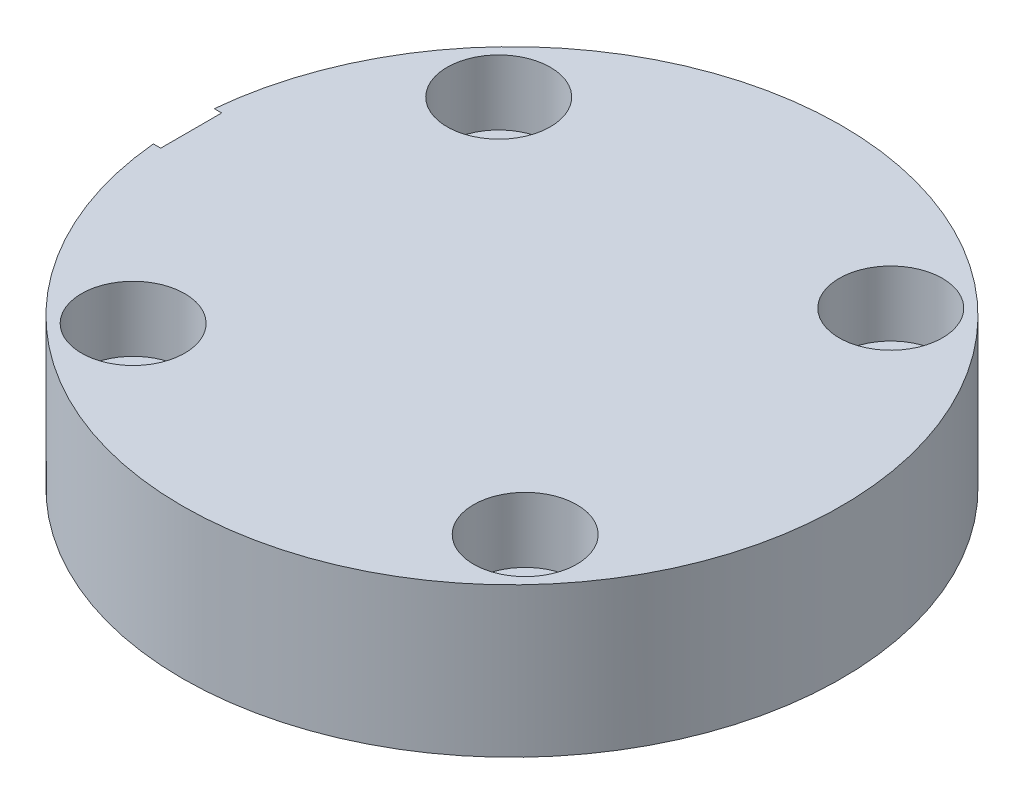
ISO-10303-21;
HEADER;
FILE_DESCRIPTION(('STEP AP214'),'2;1');
FILE_NAME('part.step','',(''),(''),'','','');
FILE_SCHEMA(('AUTOMOTIVE_DESIGN { 1 0 10303 214 1 1 1 1 }'));
ENDSEC;
DATA;
#1=APPLICATION_CONTEXT('core data for automotive mechanical design processes');
#2=APPLICATION_PROTOCOL_DEFINITION('international standard','automotive_design',2000,#1);
#3=PRODUCT_CONTEXT('',#1,'mechanical');
#4=PRODUCT('Part','Part','',(#3));
#5=PRODUCT_RELATED_PRODUCT_CATEGORY('part','',(#4));
#6=PRODUCT_DEFINITION_FORMATION('','',#4);
#7=PRODUCT_DEFINITION_CONTEXT('part definition',#1,'design');
#8=PRODUCT_DEFINITION('design','',#6,#7);
#9=PRODUCT_DEFINITION_SHAPE('','',#8);
#10=(LENGTH_UNIT() NAMED_UNIT(*) SI_UNIT(.MILLI.,.METRE.));
#11=(NAMED_UNIT(*) PLANE_ANGLE_UNIT() SI_UNIT($,.RADIAN.));
#12=(NAMED_UNIT(*) SI_UNIT($,.STERADIAN.) SOLID_ANGLE_UNIT());
#13=UNCERTAINTY_MEASURE_WITH_UNIT(LENGTH_MEASURE(1.E-05),#10,'distance_accuracy_value','');
#14=(GEOMETRIC_REPRESENTATION_CONTEXT(3) GLOBAL_UNCERTAINTY_ASSIGNED_CONTEXT((#13)) GLOBAL_UNIT_ASSIGNED_CONTEXT((#10,
#11,#12)) REPRESENTATION_CONTEXT('',''));
#15=CARTESIAN_POINT('',(0.,0.,0.));
#16=DIRECTION('',(0.,0.,1.));
#17=DIRECTION('',(1.,0.,0.));
#18=AXIS2_PLACEMENT_3D('',#15,#16,#17);
#19=CARTESIAN_POINT('',(-7.87399999990157,5.08,0.));
#20=DIRECTION('',(-1.,0.,0.));
#21=DIRECTION('',(0.,0.,1.));
#22=AXIS2_PLACEMENT_3D('',#19,#20,#21);
#23=CONICAL_SURFACE('',#22,1.983739999766,1.04719755101781);
#24=CARTESIAN_POINT('',(-6.72868717691699,5.08000000024822,0.));
#25=VERTEX_POINT('',#24);
#26=VERTEX_LOOP('',#25);
#27=FACE_BOUND('',#26,.T.);
#28=CARTESIAN_POINT('',(-7.87400000002046,4.31799999998885,1.8315513608851));
#29=CARTESIAN_POINT('',(-7.82992641507165,4.31799999999599,1.7487874157982));
#30=CARTESIAN_POINT('',(-7.78612853155752,4.31799999999893,1.66587183864565));
#31=CARTESIAN_POINT('',(-7.69951532697555,4.31800000000108,1.49941735932508));
#32=CARTESIAN_POINT('',(-7.65670110926625,4.31800000000029,1.4158778843539));
#33=CARTESIAN_POINT('',(-7.57033367638741,4.31799999999969,1.24354391983241));
#34=CARTESIAN_POINT('',(-7.52686338570844,4.31799999999994,1.15470731721397));
#35=CARTESIAN_POINT('',(-7.4638282424196,4.31800000000003,1.02045059617735));
#36=CARTESIAN_POINT('',(-7.44318188491735,4.31800000000001,0.975539839632032));
#37=CARTESIAN_POINT('',(-7.4028656854967,4.31799999999999,0.88528360930255));
#38=CARTESIAN_POINT('',(-7.38319577512093,4.318,0.839938166260351));
#39=CARTESIAN_POINT('',(-7.34376060487868,4.318,0.745289070746328));
#40=CARTESIAN_POINT('',(-7.3240976091331,4.318,0.69594240252209));
#41=CARTESIAN_POINT('',(-7.28693048358289,4.318,0.596410046130136));
#42=CARTESIAN_POINT('',(-7.26942712282796,4.318,0.546224066264776));
#43=CARTESIAN_POINT('',(-7.23782362064461,4.318,0.445817244694537));
#44=CARTESIAN_POINT('',(-7.22366519781957,4.318,0.395615139230935));
#45=CARTESIAN_POINT('',(-7.19953652322499,4.318,0.294233784560262));
#46=CARTESIAN_POINT('',(-7.18956155964946,4.318,0.243055702907522));
#47=CARTESIAN_POINT('',(-7.17638225084909,4.318,0.149378599825421));
#48=CARTESIAN_POINT('',(-7.1722714281669,4.318,0.107010084573329));
#49=CARTESIAN_POINT('',(-7.16813574122286,4.318,0.0220823809694541));
#50=CARTESIAN_POINT('',(-7.16810925530471,4.318,-0.020476724997631));
#51=CARTESIAN_POINT('',(-7.17217831317842,4.318,-0.106140326277238));
#52=CARTESIAN_POINT('',(-7.17634630374353,4.318,-0.1492412625259));
#53=CARTESIAN_POINT('',(-7.18843183722638,4.318,-0.234905726770033));
#54=CARTESIAN_POINT('',(-7.19635034442225,4.318,-0.277469113667662));
#55=CARTESIAN_POINT('',(-7.22130051202808,4.318,-0.38921137660387));
#56=CARTESIAN_POINT('',(-7.24091400946646,4.318,-0.457802750432506));
#57=CARTESIAN_POINT('',(-7.28532676075777,4.318,-0.593315839970755));
#58=CARTESIAN_POINT('',(-7.31013445530008,4.318,-0.660234637100207));
#59=CARTESIAN_POINT('',(-7.36312317579871,4.318,-0.793223443669407));
#60=CARTESIAN_POINT('',(-7.39132568943498,4.318,-0.859284762260099));
#61=CARTESIAN_POINT('',(-7.44976755026002,4.318,-0.990433560919312));
#62=CARTESIAN_POINT('',(-7.48000549787957,4.318,-1.05552167328235));
#63=CARTESIAN_POINT('',(-7.53980162534114,4.318,-1.18077415478785));
#64=CARTESIAN_POINT('',(-7.56927312674534,4.318,-1.24098015911951));
#65=CARTESIAN_POINT('',(-7.62905869548584,4.318,-1.36098500583929));
#66=CARTESIAN_POINT('',(-7.65937292043676,4.318,-1.42078376942182));
#67=CARTESIAN_POINT('',(-7.72016672603709,4.318,-1.53921324381936));
#68=CARTESIAN_POINT('',(-7.7506376801483,4.318,-1.59784839629121));
#69=CARTESIAN_POINT('',(-7.81202070273508,4.318,-1.71486748913878));
#70=CARTESIAN_POINT('',(-7.84293265051441,4.318,-1.77325149276679));
#71=CARTESIAN_POINT('',(-7.87400000002975,4.318,-1.83155136088302));
#72=B_SPLINE_CURVE_WITH_KNOTS('',3,(#28,#29,#30,#31,#32,#33,#34,#35,#36,#37,#38,#39,#40,#41,#42,
#43,#44,#45,#46,#47,#48,#49,#50,#51,#52,#53,#54,#55,#56,#57,#58,#59,#60,#61,#62,#63,#64,#65,#66,
#67,#68,#69,#70,#71),.UNSPECIFIED.,.F.,.F.,(4,2,2,2,2,2,2,2,2,2,2,2,2,2,2,2,2,2,2,2,2,4),(0.,
0.281307642365523,0.562916773289566,0.859585824160608,1.00786515542674,1.15613407630821,
1.31545920995369,1.47484091679935,1.63119792479809,1.78737835277337,1.91490226065231,
2.04237553595827,2.1720889661006,2.30183576438626,2.51548453077995,2.7294832139832,
2.94491568673733,3.16020151160627,3.36128974921865,3.56241585281412,3.76065360187342,
3.95883809795668),.UNSPECIFIED.);
#73=CARTESIAN_POINT('',(-7.87400000001428,4.318,1.83155136088839));
#74=VERTEX_POINT('',#73);
#75=CARTESIAN_POINT('',(-7.87400000001428,4.318,-1.83155136088839));
#76=VERTEX_POINT('',#75);
#77=EDGE_CURVE('E21',#74,#76,#72,.T.);
#78=ORIENTED_EDGE('',*,*,#77,.F.);
#79=CARTESIAN_POINT('',(-7.874,5.08,0.));
#80=DIRECTION('',(-1.,0.,0.));
#81=DIRECTION('',(0.,-1.,0.));
#82=AXIS2_PLACEMENT_3D('',#79,#80,#81);
#83=CIRCLE('',#82,1.98374);
#84=EDGE_CURVE('E290',#74,#76,#83,.T.);
#85=ORIENTED_EDGE('',*,*,#84,.T.);
#86=EDGE_LOOP('',(#78,#85));
#87=FACE_BOUND('',#86,.T.);
#88=ADVANCED_FACE('F17',(#27,#87),#23,.F.);
#89=CARTESIAN_POINT('',(0.,4.318,0.));
#90=DIRECTION('',(0.,-1.,0.));
#91=DIRECTION('',(0.,0.,-1.));
#92=AXIS2_PLACEMENT_3D('',#89,#90,#91);
#93=PLANE('',#92);
#94=DIRECTION('',(-1.,0.,0.));
#95=VECTOR('',#94,1.);
#96=CARTESIAN_POINT('',(-6.72868717699777,4.318,1.831551360896));
#97=LINE('',#96,#95);
#98=CARTESIAN_POINT('',(-10.1484488160704,4.318,1.831551360896));
#99=VERTEX_POINT('',#98);
#100=EDGE_CURVE('E292',#99,#74,#97,.F.);
#101=ORIENTED_EDGE('',*,*,#100,.T.);
#102=ORIENTED_EDGE('',*,*,#77,.T.);
#103=DIRECTION('',(-1.,0.,0.));
#104=VECTOR('',#103,1.);
#105=CARTESIAN_POINT('',(-6.72868717699777,4.318,-1.831551360896));
#106=LINE('',#105,#104);
#107=CARTESIAN_POINT('',(-10.1484488160704,4.318,-1.831551360896));
#108=VERTEX_POINT('',#107);
#109=EDGE_CURVE('E177',#76,#108,#106,.T.);
#110=ORIENTED_EDGE('',*,*,#109,.T.);
#111=CARTESIAN_POINT('',(0.,4.318,0.));
#112=DIRECTION('',(0.,1.,0.));
#113=DIRECTION('',(0.,0.,1.));
#114=AXIS2_PLACEMENT_3D('',#111,#112,#113);
#115=CIRCLE('',#114,10.3124);
#116=EDGE_CURVE('E176',#108,#99,#115,.F.);
#117=ORIENTED_EDGE('',*,*,#116,.T.);
#118=EDGE_LOOP('',(#101,#102,#110,#117));
#119=FACE_BOUND('',#118,.T.);
#120=ADVANCED_FACE('F64',(#119),#93,.T.);
#121=CARTESIAN_POINT('',(14.9304902420144,4.318,-4.14059139895652));
#122=DIRECTION('',(0.,1.,0.));
#123=DIRECTION('',(0.,0.,1.));
#124=AXIS2_PLACEMENT_3D('',#121,#122,#123);
#125=PLANE('',#124);
#126=CARTESIAN_POINT('',(14.9304902420144,4.318,-4.14059139895652));
#127=DIRECTION('',(0.,1.,0.));
#128=DIRECTION('',(0.,0.,1.));
#129=AXIS2_PLACEMENT_3D('',#126,#127,#128);
#130=CIRCLE('',#129,1.7272);
#131=CARTESIAN_POINT('',(14.9304902420144,4.318,-2.41339139895652));
#132=VERTEX_POINT('',#131);
#133=EDGE_CURVE('E180',#132,#132,#130,.F.);
#134=ORIENTED_EDGE('',*,*,#133,.T.);
#135=EDGE_LOOP('',(#134));
#136=FACE_BOUND('',#135,.T.);
#137=ADVANCED_FACE('F69',(#136),#125,.F.);
#138=CARTESIAN_POINT('',(-14.9304902420144,4.318,4.14059139895652));
#139=DIRECTION('',(0.,1.,0.));
#140=DIRECTION('',(0.,0.,1.));
#141=AXIS2_PLACEMENT_3D('',#138,#139,#140);
#142=PLANE('',#141);
#143=CARTESIAN_POINT('',(-14.9304902420144,4.318,4.14059139895652));
#144=DIRECTION('',(0.,1.,0.));
#145=DIRECTION('',(0.,0.,1.));
#146=AXIS2_PLACEMENT_3D('',#143,#144,#145);
#147=CIRCLE('',#146,1.7272);
#148=CARTESIAN_POINT('',(-14.9304902420144,4.318,5.86779139895652));
#149=VERTEX_POINT('',#148);
#150=EDGE_CURVE('E183',#149,#149,#147,.F.);
#151=ORIENTED_EDGE('',*,*,#150,.T.);
#152=EDGE_LOOP('',(#151));
#153=FACE_BOUND('',#152,.T.);
#154=ADVANCED_FACE('F263',(#153),#142,.F.);
#155=CARTESIAN_POINT('',(4.14059139895652,4.318,14.9304902420144));
#156=DIRECTION('',(0.,1.,0.));
#157=DIRECTION('',(0.,0.,1.));
#158=AXIS2_PLACEMENT_3D('',#155,#156,#157);
#159=PLANE('',#158);
#160=CARTESIAN_POINT('',(4.14059139895652,4.318,14.9304902420144));
#161=DIRECTION('',(0.,1.,0.));
#162=DIRECTION('',(0.,0.,1.));
#163=AXIS2_PLACEMENT_3D('',#160,#161,#162);
#164=CIRCLE('',#163,1.7272);
#165=CARTESIAN_POINT('',(4.14059139895652,4.318,16.6576902420144));
#166=VERTEX_POINT('',#165);
#167=EDGE_CURVE('E186',#166,#166,#164,.F.);
#168=ORIENTED_EDGE('',*,*,#167,.T.);
#169=EDGE_LOOP('',(#168));
#170=FACE_BOUND('',#169,.T.);
#171=ADVANCED_FACE('F268',(#170),#159,.F.);
#172=CARTESIAN_POINT('',(-4.14059139895652,4.318,-14.9304902420144));
#173=DIRECTION('',(0.,1.,0.));
#174=DIRECTION('',(0.,0.,1.));
#175=AXIS2_PLACEMENT_3D('',#172,#173,#174);
#176=PLANE('',#175);
#177=CARTESIAN_POINT('',(-4.14059139895652,4.318,-14.9304902420144));
#178=DIRECTION('',(0.,1.,0.));
#179=DIRECTION('',(0.,0.,1.));
#180=AXIS2_PLACEMENT_3D('',#177,#178,#179);
#181=CIRCLE('',#180,1.7272);
#182=CARTESIAN_POINT('',(-4.14059139895652,4.318,-13.2032902420144));
#183=VERTEX_POINT('',#182);
#184=EDGE_CURVE('E189',#183,#183,#181,.F.);
#185=ORIENTED_EDGE('',*,*,#184,.T.);
#186=EDGE_LOOP('',(#185));
#187=FACE_BOUND('',#186,.T.);
#188=ADVANCED_FACE('F274',(#187),#176,.F.);
#189=CARTESIAN_POINT('',(-6.72868717699777,5.08,0.));
#190=DIRECTION('',(-1.,0.,0.));
#191=DIRECTION('',(0.,-1.,0.));
#192=AXIS2_PLACEMENT_3D('',#189,#190,#191);
#193=CYLINDRICAL_SURFACE('',#192,1.98374);
#194=CARTESIAN_POINT('',(-18.1127399999923,5.08,0.));
#195=DIRECTION('',(-1.,0.,0.));
#196=DIRECTION('',(0.,-1.,0.));
#197=AXIS2_PLACEMENT_3D('',#194,#195,#196);
#198=CIRCLE('',#197,1.98373999999338);
#199=CARTESIAN_POINT('',(-18.1127399999923,3.09626000000662,0.));
#200=VERTEX_POINT('',#199);
#201=EDGE_CURVE('E192',#200,#200,#198,.T.);
#202=ORIENTED_EDGE('',*,*,#201,.T.);
#203=EDGE_LOOP('',(#202));
#204=FACE_BOUND('',#203,.T.);
#205=ORIENTED_EDGE('',*,*,#84,.F.);
#206=ORIENTED_EDGE('',*,*,#100,.F.);
#207=CARTESIAN_POINT('',(-10.1484488160704,4.318,1.831551360896));
#208=CARTESIAN_POINT('',(-10.1523307295266,4.26627741997668,1.81003212563262));
#209=CARTESIAN_POINT('',(-10.15653749903,4.21551387213309,1.78634128802486));
#210=CARTESIAN_POINT('',(-10.1654720150666,4.11621010978478,1.73478131015529));
#211=CARTESIAN_POINT('',(-10.1701997016872,4.06766964050244,1.70691265026827));
#212=CARTESIAN_POINT('',(-10.1849570570044,3.92597187191447,1.61737304930524));
#213=CARTESIAN_POINT('',(-10.1955740427077,3.83657361776582,1.54969974576053));
#214=CARTESIAN_POINT('',(-10.2171581892262,3.67047336798419,1.4003405696009));
#215=CARTESIAN_POINT('',(-10.2281254202561,3.59377393742458,1.31865187274376));
#216=CARTESIAN_POINT('',(-10.2491864676427,3.45514512602281,1.14347585732607));
#217=CARTESIAN_POINT('',(-10.2592804042456,3.39321370966328,1.04999016749801));
#218=CARTESIAN_POINT('',(-10.2774852960261,3.28579964890034,0.853593190312651));
#219=CARTESIAN_POINT('',(-10.2855925327254,3.24034777394583,0.750664716279641));
#220=CARTESIAN_POINT('',(-10.2988824125913,3.16743537675203,0.53843041840174));
#221=CARTESIAN_POINT('',(-10.3040650614484,3.13997481950688,0.429124606965738));
#222=CARTESIAN_POINT('',(-10.3108620074707,3.10419314226036,0.208966054624747));
#223=CARTESIAN_POINT('',(-10.3125275777648,3.09559693772033,0.0981595874973817));
#224=CARTESIAN_POINT('',(-10.3122570681653,3.09700288063558,-0.123326019492647));
#225=CARTESIAN_POINT('',(-10.3103212299676,3.10700378001201,-0.23400516740109));
#226=CARTESIAN_POINT('',(-10.303102825486,3.14508450537033,-0.450921697192626));
#227=CARTESIAN_POINT('',(-10.2978545354903,3.17297921917175,-0.5571928301728));
#228=CARTESIAN_POINT('',(-10.2846156137339,3.24581777185274,-0.763525760558363));
#229=CARTESIAN_POINT('',(-10.2766250787238,3.29076100924008,-0.863587776883885));
#230=CARTESIAN_POINT('',(-10.258674292042,3.39691372158333,-1.05574956711831));
#231=CARTESIAN_POINT('',(-10.2486958336015,3.45827549792354,-1.14776349728511));
#232=CARTESIAN_POINT('',(-10.2279021946964,3.59534570125691,-1.32029409940203));
#233=CARTESIAN_POINT('',(-10.2170868413331,3.67105709752548,-1.40080838574683));
#234=CARTESIAN_POINT('',(-10.1956355812196,3.83606527298908,-1.54930006696661));
#235=CARTESIAN_POINT('',(-10.185004621706,3.92554476283416,-1.61707660247916));
#236=CARTESIAN_POINT('',(-10.170227729714,4.06738572977835,-1.70674650905111));
#237=CARTESIAN_POINT('',(-10.1654936100975,4.11597948240959,-1.73465534615503));
#238=CARTESIAN_POINT('',(-10.156547364646,4.21539483525796,-1.78628567346737));
#239=CARTESIAN_POINT('',(-10.1523352921309,4.266216662326,-1.81000673605668));
#240=CARTESIAN_POINT('',(-10.1484488160704,4.318,-1.831551360896));
#241=B_SPLINE_CURVE_WITH_KNOTS('',3,(#207,#208,#209,#210,#211,#212,#213,#214,#215,#216,#217,
#218,#219,#220,#221,#222,#223,#224,#225,#226,#227,#228,#229,#230,#231,#232,#233,#234,#235,#236,
#237,#238,#239,#240),.UNSPECIFIED.,.F.,.F.,(4,2,2,2,2,2,2,2,2,2,2,2,2,2,2,2,4),(0.,
0.168357652079969,0.336695960870139,0.672842913717333,1.00905768327299,1.34522608457076,
1.68201896246432,2.01881118505528,2.35065864720445,2.6824838393889,3.01093046505153,
3.33936550380318,3.67095964884576,4.00262248361132,4.33914225790786,4.50767980160798,
4.67623454495431),.UNSPECIFIED.);
#242=EDGE_CURVE('E170',#99,#108,#241,.T.);
#243=ORIENTED_EDGE('',*,*,#242,.T.);
#244=ORIENTED_EDGE('',*,*,#109,.F.);
#245=EDGE_LOOP('',(#205,#206,#243,#244));
#246=FACE_BOUND('',#245,.T.);
#247=ADVANCED_FACE('F166',(#204,#246),#193,.F.);
#248=CARTESIAN_POINT('',(0.,0.,0.));
#249=DIRECTION('',(0.,1.,0.));
#250=DIRECTION('',(0.,0.,1.));
#251=AXIS2_PLACEMENT_3D('',#248,#249,#250);
#252=CYLINDRICAL_SURFACE('',#251,10.3124);
#253=ORIENTED_EDGE('',*,*,#242,.F.);
#254=ORIENTED_EDGE('',*,*,#116,.F.);
#255=EDGE_LOOP('',(#253,#254));
#256=FACE_BOUND('',#255,.T.);
#257=CARTESIAN_POINT('',(0.,0.,0.));
#258=DIRECTION('',(0.,1.,0.));
#259=DIRECTION('',(0.,0.,1.));
#260=AXIS2_PLACEMENT_3D('',#257,#258,#259);
#261=CIRCLE('',#260,10.3124);
#262=CARTESIAN_POINT('',(0.,0.,10.3124));
#263=VERTEX_POINT('',#262);
#264=EDGE_CURVE('E193',#263,#263,#261,.F.);
#265=ORIENTED_EDGE('',*,*,#264,.T.);
#266=EDGE_LOOP('',(#265));
#267=FACE_BOUND('',#266,.T.);
#268=ADVANCED_FACE('F161',(#256,#267),#252,.F.);
#269=CARTESIAN_POINT('',(14.9304902420144,4.318,-4.14059139895652));
#270=DIRECTION('',(0.,1.,0.));
#271=DIRECTION('',(0.,0.,1.));
#272=AXIS2_PLACEMENT_3D('',#269,#270,#271);
#273=CYLINDRICAL_SURFACE('',#272,1.7272);
#274=CARTESIAN_POINT('',(14.9304902420144,0.,-4.14059139895652));
#275=DIRECTION('',(0.,1.,0.));
#276=DIRECTION('',(0.,0.,1.));
#277=AXIS2_PLACEMENT_3D('',#274,#275,#276);
#278=CIRCLE('',#277,1.7272);
#279=CARTESIAN_POINT('',(14.9304902420144,0.,-2.41339139895652));
#280=VERTEX_POINT('',#279);
#281=EDGE_CURVE('E196',#280,#280,#278,.F.);
#282=ORIENTED_EDGE('',*,*,#281,.T.);
#283=EDGE_LOOP('',(#282));
#284=FACE_BOUND('',#283,.T.);
#285=ORIENTED_EDGE('',*,*,#133,.F.);
#286=EDGE_LOOP('',(#285));
#287=FACE_BOUND('',#286,.T.);
#288=ADVANCED_FACE('F157',(#284,#287),#273,.F.);
#289=CARTESIAN_POINT('',(-14.9304902420144,4.318,4.14059139895652));
#290=DIRECTION('',(0.,1.,0.));
#291=DIRECTION('',(0.,0.,1.));
#292=AXIS2_PLACEMENT_3D('',#289,#290,#291);
#293=CYLINDRICAL_SURFACE('',#292,1.7272);
#294=CARTESIAN_POINT('',(-14.9304902420144,0.,4.14059139895652));
#295=DIRECTION('',(0.,1.,0.));
#296=DIRECTION('',(0.,0.,1.));
#297=AXIS2_PLACEMENT_3D('',#294,#295,#296);
#298=CIRCLE('',#297,1.7272);
#299=CARTESIAN_POINT('',(-14.9304902420144,0.,5.86779139895652));
#300=VERTEX_POINT('',#299);
#301=EDGE_CURVE('E199',#300,#300,#298,.F.);
#302=ORIENTED_EDGE('',*,*,#301,.T.);
#303=EDGE_LOOP('',(#302));
#304=FACE_BOUND('',#303,.T.);
#305=ORIENTED_EDGE('',*,*,#150,.F.);
#306=EDGE_LOOP('',(#305));
#307=FACE_BOUND('',#306,.T.);
#308=ADVANCED_FACE('F153',(#304,#307),#293,.F.);
#309=CARTESIAN_POINT('',(4.14059139895652,4.318,14.9304902420144));
#310=DIRECTION('',(0.,1.,0.));
#311=DIRECTION('',(0.,0.,1.));
#312=AXIS2_PLACEMENT_3D('',#309,#310,#311);
#313=CYLINDRICAL_SURFACE('',#312,1.7272);
#314=CARTESIAN_POINT('',(4.14059139895652,0.,14.9304902420144));
#315=DIRECTION('',(0.,1.,0.));
#316=DIRECTION('',(0.,0.,1.));
#317=AXIS2_PLACEMENT_3D('',#314,#315,#316);
#318=CIRCLE('',#317,1.7272);
#319=CARTESIAN_POINT('',(4.14059139895652,0.,16.6576902420144));
#320=VERTEX_POINT('',#319);
#321=EDGE_CURVE('E214',#320,#320,#318,.F.);
#322=ORIENTED_EDGE('',*,*,#321,.T.);
#323=EDGE_LOOP('',(#322));
#324=FACE_BOUND('',#323,.T.);
#325=ORIENTED_EDGE('',*,*,#167,.F.);
#326=EDGE_LOOP('',(#325));
#327=FACE_BOUND('',#326,.T.);
#328=ADVANCED_FACE('F149',(#324,#327),#313,.F.);
#329=CARTESIAN_POINT('',(-4.14059139895652,4.318,-14.9304902420144));
#330=DIRECTION('',(0.,1.,0.));
#331=DIRECTION('',(0.,0.,1.));
#332=AXIS2_PLACEMENT_3D('',#329,#330,#331);
#333=CYLINDRICAL_SURFACE('',#332,1.7272);
#334=CARTESIAN_POINT('',(-4.14059139895652,0.,-14.9304902420144));
#335=DIRECTION('',(0.,1.,0.));
#336=DIRECTION('',(0.,0.,1.));
#337=AXIS2_PLACEMENT_3D('',#334,#335,#336);
#338=CIRCLE('',#337,1.7272);
#339=CARTESIAN_POINT('',(-4.14059139895652,0.,-13.2032902420144));
#340=VERTEX_POINT('',#339);
#341=EDGE_CURVE('E217',#340,#340,#338,.F.);
#342=ORIENTED_EDGE('',*,*,#341,.T.);
#343=EDGE_LOOP('',(#342));
#344=FACE_BOUND('',#343,.T.);
#345=ORIENTED_EDGE('',*,*,#184,.F.);
#346=EDGE_LOOP('',(#345));
#347=FACE_BOUND('',#346,.T.);
#348=ADVANCED_FACE('F145',(#344,#347),#333,.F.);
#349=CARTESIAN_POINT('',(10.5668825908083,8.636,-11.3315942528874));
#350=DIRECTION('',(0.,-1.,0.));
#351=DIRECTION('',(0.,0.,-1.));
#352=AXIS2_PLACEMENT_3D('',#349,#350,#351);
#353=CYLINDRICAL_SURFACE('',#352,1.98119999999999);
#354=CARTESIAN_POINT('',(10.5668825908083,0.,-11.3315942528874));
#355=DIRECTION('',(0.,-1.,0.));
#356=DIRECTION('',(0.,0.,-1.));
#357=AXIS2_PLACEMENT_3D('',#354,#355,#356);
#358=CIRCLE('',#357,1.98119999999999);
#359=CARTESIAN_POINT('',(10.5668825908083,0.,-13.3127942528874));
#360=VERTEX_POINT('',#359);
#361=EDGE_CURVE('E211',#360,#360,#358,.T.);
#362=ORIENTED_EDGE('',*,*,#361,.T.);
#363=EDGE_LOOP('',(#362));
#364=FACE_BOUND('',#363,.T.);
#365=CARTESIAN_POINT('',(10.5668825908083,4.8768,-11.3315942528874));
#366=DIRECTION('',(0.,-1.,0.));
#367=DIRECTION('',(0.,0.,-1.));
#368=AXIS2_PLACEMENT_3D('',#365,#366,#367);
#369=CIRCLE('',#368,1.98119999999999);
#370=CARTESIAN_POINT('',(10.5668825908083,4.8768,-13.3127942528874));
#371=VERTEX_POINT('',#370);
#372=EDGE_CURVE('E221',#371,#371,#369,.T.);
#373=ORIENTED_EDGE('',*,*,#372,.F.);
#374=EDGE_LOOP('',(#373));
#375=FACE_BOUND('',#374,.T.);
#376=ADVANCED_FACE('F141',(#364,#375),#353,.F.);
#377=CARTESIAN_POINT('',(-10.5668825908083,8.636,11.3315942528874));
#378=DIRECTION('',(0.,-1.,0.));
#379=DIRECTION('',(0.,0.,-1.));
#380=AXIS2_PLACEMENT_3D('',#377,#378,#379);
#381=CYLINDRICAL_SURFACE('',#380,1.98119999999999);
#382=CARTESIAN_POINT('',(-10.5668825908083,0.,11.3315942528874));
#383=DIRECTION('',(0.,-1.,0.));
#384=DIRECTION('',(0.,0.,-1.));
#385=AXIS2_PLACEMENT_3D('',#382,#383,#384);
#386=CIRCLE('',#385,1.98119999999999);
#387=CARTESIAN_POINT('',(-10.5668825908083,0.,9.35039425288743));
#388=VERTEX_POINT('',#387);
#389=EDGE_CURVE('E208',#388,#388,#386,.T.);
#390=ORIENTED_EDGE('',*,*,#389,.T.);
#391=EDGE_LOOP('',(#390));
#392=FACE_BOUND('',#391,.T.);
#393=CARTESIAN_POINT('',(-10.5668825908083,4.8768,11.3315942528874));
#394=DIRECTION('',(0.,-1.,0.));
#395=DIRECTION('',(0.,0.,-1.));
#396=AXIS2_PLACEMENT_3D('',#393,#394,#395);
#397=CIRCLE('',#396,1.98119999999999);
#398=CARTESIAN_POINT('',(-10.5668825908083,4.8768,9.35039425288743));
#399=VERTEX_POINT('',#398);
#400=EDGE_CURVE('E224',#399,#399,#397,.T.);
#401=ORIENTED_EDGE('',*,*,#400,.F.);
#402=EDGE_LOOP('',(#401));
#403=FACE_BOUND('',#402,.T.);
#404=ADVANCED_FACE('F137',(#392,#403),#381,.F.);
#405=CARTESIAN_POINT('',(11.3315942528874,8.636,10.5668825908083));
#406=DIRECTION('',(0.,-1.,0.));
#407=DIRECTION('',(0.,0.,-1.));
#408=AXIS2_PLACEMENT_3D('',#405,#406,#407);
#409=CYLINDRICAL_SURFACE('',#408,1.9812);
#410=CARTESIAN_POINT('',(11.3315942528874,0.,10.5668825908083));
#411=DIRECTION('',(0.,-1.,0.));
#412=DIRECTION('',(0.,0.,-1.));
#413=AXIS2_PLACEMENT_3D('',#410,#411,#412);
#414=CIRCLE('',#413,1.9812);
#415=CARTESIAN_POINT('',(11.3315942528874,0.,8.58568259080835));
#416=VERTEX_POINT('',#415);
#417=EDGE_CURVE('E205',#416,#416,#414,.T.);
#418=ORIENTED_EDGE('',*,*,#417,.T.);
#419=EDGE_LOOP('',(#418));
#420=FACE_BOUND('',#419,.T.);
#421=CARTESIAN_POINT('',(11.3315942528874,4.8768,10.5668825908083));
#422=DIRECTION('',(0.,-1.,0.));
#423=DIRECTION('',(0.,0.,-1.));
#424=AXIS2_PLACEMENT_3D('',#421,#422,#423);
#425=CIRCLE('',#424,1.9812);
#426=CARTESIAN_POINT('',(11.3315942528874,4.8768,8.58568259080835));
#427=VERTEX_POINT('',#426);
#428=EDGE_CURVE('E227',#427,#427,#425,.T.);
#429=ORIENTED_EDGE('',*,*,#428,.F.);
#430=EDGE_LOOP('',(#429));
#431=FACE_BOUND('',#430,.T.);
#432=ADVANCED_FACE('F133',(#420,#431),#409,.F.);
#433=CARTESIAN_POINT('',(-11.3315942528874,8.636,-10.5668825908083));
#434=DIRECTION('',(0.,-1.,0.));
#435=DIRECTION('',(0.,0.,-1.));
#436=AXIS2_PLACEMENT_3D('',#433,#434,#435);
#437=CYLINDRICAL_SURFACE('',#436,1.9812);
#438=CARTESIAN_POINT('',(-11.3315942528874,0.,-10.5668825908083));
#439=DIRECTION('',(0.,-1.,0.));
#440=DIRECTION('',(0.,0.,-1.));
#441=AXIS2_PLACEMENT_3D('',#438,#439,#440);
#442=CIRCLE('',#441,1.9812);
#443=CARTESIAN_POINT('',(-11.3315942528874,0.,-12.5480825908083));
#444=VERTEX_POINT('',#443);
#445=EDGE_CURVE('E202',#444,#444,#442,.T.);
#446=ORIENTED_EDGE('',*,*,#445,.T.);
#447=EDGE_LOOP('',(#446));
#448=FACE_BOUND('',#447,.T.);
#449=CARTESIAN_POINT('',(-11.3315942528874,4.8768,-10.5668825908083));
#450=DIRECTION('',(0.,-1.,0.));
#451=DIRECTION('',(0.,0.,-1.));
#452=AXIS2_PLACEMENT_3D('',#449,#450,#451);
#453=CIRCLE('',#452,1.9812);
#454=CARTESIAN_POINT('',(-11.3315942528874,4.8768,-12.5480825908083));
#455=VERTEX_POINT('',#454);
#456=EDGE_CURVE('E230',#455,#455,#453,.T.);
#457=ORIENTED_EDGE('',*,*,#456,.F.);
#458=EDGE_LOOP('',(#457));
#459=FACE_BOUND('',#458,.T.);
#460=ADVANCED_FACE('F129',(#448,#459),#437,.F.);
#461=CARTESIAN_POINT('',(-18.5419999999681,5.08,0.));
#462=DIRECTION('',(-1.,0.,0.));
#463=DIRECTION('',(0.,0.,1.));
#464=AXIS2_PLACEMENT_3D('',#461,#462,#463);
#465=CONICAL_SURFACE('',#464,2.41299999996916,0.785398163397448);
#466=CARTESIAN_POINT('',(-18.5420000000249,5.08,0.));
#467=DIRECTION('',(-1.,0.,0.));
#468=DIRECTION('',(0.,0.,1.));
#469=AXIS2_PLACEMENT_3D('',#466,#467,#468);
#470=CIRCLE('',#469,2.41300000002601);
#471=CARTESIAN_POINT('',(-18.5420000000249,5.08,2.41300000002601));
#472=VERTEX_POINT('',#471);
#473=EDGE_CURVE('E233',#472,#472,#470,.F.);
#474=ORIENTED_EDGE('',*,*,#473,.F.);
#475=EDGE_LOOP('',(#474));
#476=FACE_BOUND('',#475,.T.);
#477=ORIENTED_EDGE('',*,*,#201,.F.);
#478=EDGE_LOOP('',(#477));
#479=FACE_BOUND('',#478,.T.);
#480=ADVANCED_FACE('F125',(#476,#479),#465,.F.);
#481=CARTESIAN_POINT('',(19.05,0.,0.));
#482=DIRECTION('',(0.,1.,0.));
#483=DIRECTION('',(0.,0.,1.));
#484=AXIS2_PLACEMENT_3D('',#481,#482,#483);
#485=PLANE('',#484);
#486=ORIENTED_EDGE('',*,*,#341,.F.);
#487=EDGE_LOOP('',(#486));
#488=FACE_BOUND('',#487,.T.);
#489=ORIENTED_EDGE('',*,*,#321,.F.);
#490=EDGE_LOOP('',(#489));
#491=FACE_BOUND('',#490,.T.);
#492=CARTESIAN_POINT('',(0.,0.,0.));
#493=DIRECTION('',(0.,1.,0.));
#494=DIRECTION('',(0.,0.,1.));
#495=AXIS2_PLACEMENT_3D('',#492,#493,#494);
#496=CIRCLE('',#495,19.05);
#497=CARTESIAN_POINT('',(0.,0.,19.05));
#498=VERTEX_POINT('',#497);
#499=EDGE_CURVE('E112',#498,#498,#496,.T.);
#500=ORIENTED_EDGE('',*,*,#499,.F.);
#501=EDGE_LOOP('',(#500));
#502=FACE_BOUND('',#501,.T.);
#503=ORIENTED_EDGE('',*,*,#361,.F.);
#504=EDGE_LOOP('',(#503));
#505=FACE_BOUND('',#504,.T.);
#506=ORIENTED_EDGE('',*,*,#389,.F.);
#507=EDGE_LOOP('',(#506));
#508=FACE_BOUND('',#507,.T.);
#509=ORIENTED_EDGE('',*,*,#417,.F.);
#510=EDGE_LOOP('',(#509));
#511=FACE_BOUND('',#510,.T.);
#512=ORIENTED_EDGE('',*,*,#445,.F.);
#513=EDGE_LOOP('',(#512));
#514=FACE_BOUND('',#513,.T.);
#515=ORIENTED_EDGE('',*,*,#301,.F.);
#516=EDGE_LOOP('',(#515));
#517=FACE_BOUND('',#516,.T.);
#518=ORIENTED_EDGE('',*,*,#281,.F.);
#519=EDGE_LOOP('',(#518));
#520=FACE_BOUND('',#519,.T.);
#521=ORIENTED_EDGE('',*,*,#264,.F.);
#522=EDGE_LOOP('',(#521));
#523=FACE_BOUND('',#522,.T.);
#524=ADVANCED_FACE('F121',(#488,#491,#502,#505,#508,#511,#514,#517,#520,#523),#485,.F.);
#525=CARTESIAN_POINT('',(-6.72868717699777,5.08,0.));
#526=DIRECTION('',(-1.,0.,0.));
#527=DIRECTION('',(0.,-1.,0.));
#528=AXIS2_PLACEMENT_3D('',#525,#526,#527);
#529=CYLINDRICAL_SURFACE('',#528,3.96875);
#530=CARTESIAN_POINT('',(-18.968306709812,8.636,1.76233951396999));
#531=CARTESIAN_POINT('',(-18.958973143008,8.58619641595597,1.86285332701888));
#532=CARTESIAN_POINT('',(-18.9490255242818,8.53214126342431,1.96119268943214));
#533=CARTESIAN_POINT('',(-18.9282036775732,8.41596585477278,2.15286953737453));
#534=CARTESIAN_POINT('',(-18.9173295472481,8.35384644828931,2.24620754837621));
#535=CARTESIAN_POINT('',(-18.8949595211944,8.22200196483474,2.4272061282805));
#536=CARTESIAN_POINT('',(-18.8834639304195,8.15228060140374,2.51486943620446));
#537=CARTESIAN_POINT('',(-18.8601743041454,8.00573018806637,2.68395474043861));
#538=CARTESIAN_POINT('',(-18.8483802664707,7.92890108633972,2.76537669123713));
#539=CARTESIAN_POINT('',(-18.8130415561964,7.68846180985588,2.99947333836041));
#540=CARTESIAN_POINT('',(-18.7895254061489,7.5148156123719,3.14209397921449));
#541=CARTESIAN_POINT('',(-18.7452876715467,7.14586200820588,3.39608674481462));
#542=CARTESIAN_POINT('',(-18.7245654930498,6.95055922141973,3.50746551641281));
#543=CARTESIAN_POINT('',(-18.6883165743046,6.54375495856328,3.6957459443969));
#544=CARTESIAN_POINT('',(-18.6727839928002,6.33227202628185,3.77268639690454));
#545=CARTESIAN_POINT('',(-18.64873941695,5.89896331077317,3.88981257071471));
#546=CARTESIAN_POINT('',(-18.640227320372,5.67713767820581,3.92999882723204));
#547=CARTESIAN_POINT('',(-18.6313484869153,5.23405341146186,3.97187670625916));
#548=CARTESIAN_POINT('',(-18.630827607966,5.01286657184159,3.97429681334053));
#549=CARTESIAN_POINT('',(-18.6375957868141,4.57329670753198,3.94243342513674));
#550=CARTESIAN_POINT('',(-18.6448840815895,4.35491341102258,3.9081535157523));
#551=CARTESIAN_POINT('',(-18.6663197260181,3.92896342125706,3.80443821890758));
#552=CARTESIAN_POINT('',(-18.6804097045272,3.72132205758919,3.73529667073165));
#553=CARTESIAN_POINT('',(-18.7138264053601,3.32053739830261,3.56409411206284));
#554=CARTESIAN_POINT('',(-18.733153726959,3.12739576502529,3.46202933412463));
#555=CARTESIAN_POINT('',(-18.7752479826415,2.75778087062878,3.22600499179433));
#556=CARTESIAN_POINT('',(-18.7980642002181,2.58161727621635,3.09156937565959));
#557=CARTESIAN_POINT('',(-18.8443863772706,2.25409951155382,2.795358051084));
#558=CARTESIAN_POINT('',(-18.8678924048525,2.10274780080019,2.63357963549202));
#559=CARTESIAN_POINT('',(-18.913379767912,1.82680767384406,2.28429372661631));
#560=CARTESIAN_POINT('',(-18.9353322468822,1.70266453239126,2.09643020667184));
#561=CARTESIAN_POINT('',(-18.974842871623,1.48773836687205,1.7020724594519));
#562=CARTESIAN_POINT('',(-18.9924012780855,1.39695336358146,1.49557933842436));
#563=CARTESIAN_POINT('',(-19.0210138401898,1.25214555516241,1.07157371465099));
#564=CARTESIAN_POINT('',(-19.0321210406746,1.1978223505717,0.854167524451751));
#565=CARTESIAN_POINT('',(-19.0467981758083,1.12649038306393,0.41307803869341));
#566=CARTESIAN_POINT('',(-19.0503690791397,1.10947682451792,0.189395553607294));
#567=CARTESIAN_POINT('',(-19.0495772317718,1.11328085877481,-0.253484204795387));
#568=CARTESIAN_POINT('',(-19.0453597540993,1.13340572109987,-0.472688033727688));
#569=CARTESIAN_POINT('',(-19.0297412457593,1.2094834061704,-0.904513423398368));
#570=CARTESIAN_POINT('',(-19.0183402156396,1.26543622618358,-1.11713498463872));
#571=CARTESIAN_POINT('',(-18.9896018543378,1.41141158594472,-1.52981412386954));
#572=CARTESIAN_POINT('',(-18.9722664470846,1.50142308484162,-1.72987574895449));
#573=CARTESIAN_POINT('',(-18.9335185849823,1.71289875322802,-2.11218894646345));
#574=CARTESIAN_POINT('',(-18.912105668448,1.83436648498182,-2.29443849853567));
#575=CARTESIAN_POINT('',(-18.867069513541,2.10791786285437,-2.63951874170536));
#576=CARTESIAN_POINT('',(-18.8434130803624,2.26051957816155,-2.80193455206637));
#577=CARTESIAN_POINT('',(-18.7968362957805,2.59078196332186,-3.09905069849851));
#578=CARTESIAN_POINT('',(-18.7739160022984,2.76844459913091,-3.23374885816074));
#579=CARTESIAN_POINT('',(-18.7311738195718,3.1458904635683,-3.47283296916352));
#580=CARTESIAN_POINT('',(-18.7113836082402,3.3458687287423,-3.57691717489517));
#581=CARTESIAN_POINT('',(-18.6774913752077,3.76095608566633,-3.74988482460711));
#582=CARTESIAN_POINT('',(-18.6633886160861,3.97606321159627,-3.81877283234714));
#583=CARTESIAN_POINT('',(-18.642721210832,4.41200351153387,-3.91842106231878));
#584=CARTESIAN_POINT('',(-18.6360503439418,4.63270862748064,-3.9497190619254));
#585=CARTESIAN_POINT('',(-18.6306834804124,5.07634105591598,-3.9749607463178));
#586=CARTESIAN_POINT('',(-18.6319870207985,5.29926823864658,-3.96890659967758));
#587=CARTESIAN_POINT('',(-18.6423242175272,5.73719962728297,-3.92005548210126));
#588=CARTESIAN_POINT('',(-18.6512326241226,5.9522736511782,-3.87785381182771));
#589=CARTESIAN_POINT('',(-18.6755815307074,6.37220346109661,-3.75883035614602));
#590=CARTESIAN_POINT('',(-18.6910216176735,6.5770598923021,-3.68201075974282));
#591=CARTESIAN_POINT('',(-18.7268288487942,6.97254820054594,-3.49534714819804));
#592=CARTESIAN_POINT('',(-18.747232847204,7.16305902726109,-3.38525454475526));
#593=CARTESIAN_POINT('',(-18.7906601126224,7.52323240535834,-3.13522029138339));
#594=CARTESIAN_POINT('',(-18.813684081736,7.69288934281656,-2.9952706314703));
#595=CARTESIAN_POINT('',(-18.8485141610752,7.92978317919434,-2.76446204775276));
#596=CARTESIAN_POINT('',(-18.860294644806,8.00650320524893,-2.68310649950866));
#597=CARTESIAN_POINT('',(-18.8835569249808,8.15284989075131,-2.51416862108585));
#598=CARTESIAN_POINT('',(-18.8950387179518,8.22247646774784,-2.42658621854891));
#599=CARTESIAN_POINT('',(-18.9173832403401,8.35415509563139,-2.24575212905131));
#600=CARTESIAN_POINT('',(-18.9282455913533,8.41620254246069,-2.15249704714791));
#601=CARTESIAN_POINT('',(-18.9490451981353,8.53224822268096,-1.96099811666389));
#602=CARTESIAN_POINT('',(-18.9589823730027,8.58624575240042,-1.86275383296476));
#603=CARTESIAN_POINT('',(-18.968306709812,8.636,-1.76233951396999));
#604=B_SPLINE_CURVE_WITH_KNOTS('',3,(#530,#531,#532,#533,#534,#535,#536,#537,#538,#539,#540,
#541,#542,#543,#544,#545,#546,#547,#548,#549,#550,#551,#552,#553,#554,#555,#556,#557,#558,#559,
#560,#561,#562,#563,#564,#565,#566,#567,#568,#569,#570,#571,#572,#573,#574,#575,#576,#577,#578,
#579,#580,#581,#582,#583,#584,#585,#586,#587,#588,#589,#590,#591,#592,#593,#594,#595,#596,#597,
#598,#599,#600,#601,#602,#603),.UNSPECIFIED.,.F.,.F.,(4,2,2,2,2,2,2,2,2,2,2,2,2,2,2,2,2,2,2,2,2,
2,2,2,2,2,2,2,2,2,2,2,2,2,2,2,4),(0.,0.33757281603946,0.675110094788699,1.01248321982203,
1.34985880473057,2.02418534569581,2.69836831156711,3.37178986038956,4.04520160268767,
4.70560725445807,5.36594838492269,6.0208144645713,6.67575550794353,7.3409896625001,
8.00628971906775,8.6817766310788,9.35722345823893,10.0270348103806,10.6967600626695,
11.3541192135724,12.0114783143439,12.6686245003811,13.3258451375726,13.9950546571899,
14.6643167035624,15.3399697793772,16.0155352235287,16.6813160341803,17.3470581915947,
18.0020427558191,18.6569859090326,19.3169485733201,19.9770885140546,20.3140905703443,
20.6510965433565,20.9883062282828,21.3255453726298),.UNSPECIFIED.);
#605=CARTESIAN_POINT('',(-18.968306709812,8.636,1.76233951396999));
#606=VERTEX_POINT('',#605);
#607=CARTESIAN_POINT('',(-18.968306709812,8.636,-1.76233951396999));
#608=VERTEX_POINT('',#607);
#609=EDGE_CURVE('E104',#606,#608,#604,.T.);
#610=ORIENTED_EDGE('',*,*,#609,.F.);
#611=DIRECTION('',(-1.,0.,0.));
#612=VECTOR('',#611,1.);
#613=CARTESIAN_POINT('',(-6.72868717699777,8.636,1.76233951397));
#614=LINE('',#613,#612);
#615=CARTESIAN_POINT('',(-18.542,8.636,1.76233951397));
#616=VERTEX_POINT('',#615);
#617=EDGE_CURVE('E220',#616,#606,#614,.T.);
#618=ORIENTED_EDGE('',*,*,#617,.F.);
#619=CARTESIAN_POINT('',(-18.542,5.08,0.));
#620=DIRECTION('',(-1.,0.,0.));
#621=DIRECTION('',(0.,-1.,0.));
#622=AXIS2_PLACEMENT_3D('',#619,#620,#621);
#623=CIRCLE('',#622,3.96875);
#624=CARTESIAN_POINT('',(-18.542,8.636,-1.76233951397));
#625=VERTEX_POINT('',#624);
#626=EDGE_CURVE('E235',#625,#616,#623,.T.);
#627=ORIENTED_EDGE('',*,*,#626,.F.);
#628=DIRECTION('',(-1.,0.,0.));
#629=VECTOR('',#628,1.);
#630=CARTESIAN_POINT('',(-6.72868717699777,8.636,-1.76233951396999));
#631=LINE('',#630,#629);
#632=EDGE_CURVE('E39',#608,#625,#631,.F.);
#633=ORIENTED_EDGE('',*,*,#632,.F.);
#634=EDGE_LOOP('',(#610,#618,#627,#633));
#635=FACE_BOUND('',#634,.T.);
#636=ADVANCED_FACE('F115',(#635),#529,.F.);
#637=CARTESIAN_POINT('',(11.9180577417642,4.8768,-12.7805522065353));
#638=DIRECTION('',(0.,1.,0.));
#639=DIRECTION('',(0.,0.,1.));
#640=AXIS2_PLACEMENT_3D('',#637,#638,#639);
#641=PLANE('',#640);
#642=ORIENTED_EDGE('',*,*,#372,.T.);
#643=EDGE_LOOP('',(#642));
#644=FACE_BOUND('',#643,.T.);
#645=CARTESIAN_POINT('',(10.5668825908083,4.8768,-11.3315942528874));
#646=DIRECTION('',(0.,-1.,0.));
#647=DIRECTION('',(0.,0.,-1.));
#648=AXIS2_PLACEMENT_3D('',#645,#646,#647);
#649=CIRCLE('',#648,2.9845);
#650=CARTESIAN_POINT('',(10.5668825908083,4.8768,-14.3160942528874));
#651=VERTEX_POINT('',#650);
#652=EDGE_CURVE('E111',#651,#651,#649,.F.);
#653=ORIENTED_EDGE('',*,*,#652,.T.);
#654=EDGE_LOOP('',(#653));
#655=FACE_BOUND('',#654,.T.);
#656=ADVANCED_FACE('F120',(#644,#655),#641,.T.);
#657=CARTESIAN_POINT('',(-11.9180577417642,4.8768,12.7805522065353));
#658=DIRECTION('',(0.,1.,0.));
#659=DIRECTION('',(0.,0.,1.));
#660=AXIS2_PLACEMENT_3D('',#657,#658,#659);
#661=PLANE('',#660);
#662=ORIENTED_EDGE('',*,*,#400,.T.);
#663=EDGE_LOOP('',(#662));
#664=FACE_BOUND('',#663,.T.);
#665=CARTESIAN_POINT('',(-10.5668825908083,4.8768,11.3315942528874));
#666=DIRECTION('',(0.,-1.,0.));
#667=DIRECTION('',(0.,0.,-1.));
#668=AXIS2_PLACEMENT_3D('',#665,#666,#667);
#669=CIRCLE('',#668,2.9845);
#670=CARTESIAN_POINT('',(-10.5668825908083,4.8768,8.34709425288743));
#671=VERTEX_POINT('',#670);
#672=EDGE_CURVE('E317',#671,#671,#669,.F.);
#673=ORIENTED_EDGE('',*,*,#672,.T.);
#674=EDGE_LOOP('',(#673));
#675=FACE_BOUND('',#674,.T.);
#676=ADVANCED_FACE('F348',(#664,#675),#661,.T.);
#677=CARTESIAN_POINT('',(9.88263629923953,4.8768,9.21570743985252));
#678=DIRECTION('',(0.,1.,0.));
#679=DIRECTION('',(0.,0.,1.));
#680=AXIS2_PLACEMENT_3D('',#677,#678,#679);
#681=PLANE('',#680);
#682=ORIENTED_EDGE('',*,*,#428,.T.);
#683=EDGE_LOOP('',(#682));
#684=FACE_BOUND('',#683,.T.);
#685=CARTESIAN_POINT('',(11.3315942528874,4.8768,10.5668825908083));
#686=DIRECTION('',(0.,-1.,0.));
#687=DIRECTION('',(0.,0.,-1.));
#688=AXIS2_PLACEMENT_3D('',#685,#686,#687);
#689=CIRCLE('',#688,2.9845);
#690=CARTESIAN_POINT('',(11.3315942528874,4.8768,7.58238259080835));
#691=VERTEX_POINT('',#690);
#692=EDGE_CURVE('E315',#691,#691,#689,.F.);
#693=ORIENTED_EDGE('',*,*,#692,.T.);
#694=EDGE_LOOP('',(#693));
#695=FACE_BOUND('',#694,.T.);
#696=ADVANCED_FACE('F343',(#684,#695),#681,.T.);
#697=CARTESIAN_POINT('',(-9.88263629923953,4.8768,-9.21570743985252));
#698=DIRECTION('',(0.,1.,0.));
#699=DIRECTION('',(0.,0.,1.));
#700=AXIS2_PLACEMENT_3D('',#697,#698,#699);
#701=PLANE('',#700);
#702=ORIENTED_EDGE('',*,*,#456,.T.);
#703=EDGE_LOOP('',(#702));
#704=FACE_BOUND('',#703,.T.);
#705=CARTESIAN_POINT('',(-11.3315942528874,4.8768,-10.5668825908083));
#706=DIRECTION('',(0.,-1.,0.));
#707=DIRECTION('',(0.,0.,-1.));
#708=AXIS2_PLACEMENT_3D('',#705,#706,#707);
#709=CIRCLE('',#708,2.9845);
#710=CARTESIAN_POINT('',(-11.3315942528874,4.8768,-13.5513825908083));
#711=VERTEX_POINT('',#710);
#712=EDGE_CURVE('E312',#711,#711,#709,.F.);
#713=ORIENTED_EDGE('',*,*,#712,.T.);
#714=EDGE_LOOP('',(#713));
#715=FACE_BOUND('',#714,.T.);
#716=ADVANCED_FACE('F337',(#704,#715),#701,.T.);
#717=CARTESIAN_POINT('',(-18.542,9.04875,0.));
#718=DIRECTION('',(-1.,0.,0.));
#719=DIRECTION('',(0.,-1.,0.));
#720=AXIS2_PLACEMENT_3D('',#717,#718,#719);
#721=PLANE('',#720);
#722=ORIENTED_EDGE('',*,*,#626,.T.);
#723=DIRECTION('',(0.,0.,-1.));
#724=VECTOR('',#723,1.);
#725=CARTESIAN_POINT('',(-18.542,8.636,0.));
#726=LINE('',#725,#724);
#727=EDGE_CURVE('E311',#616,#625,#726,.T.);
#728=ORIENTED_EDGE('',*,*,#727,.T.);
#729=EDGE_LOOP('',(#722,#728));
#730=FACE_BOUND('',#729,.T.);
#731=ORIENTED_EDGE('',*,*,#473,.T.);
#732=EDGE_LOOP('',(#731));
#733=FACE_BOUND('',#732,.T.);
#734=ADVANCED_FACE('F100',(#730,#733),#721,.T.);
#735=CARTESIAN_POINT('',(0.,0.,0.));
#736=DIRECTION('',(0.,1.,0.));
#737=DIRECTION('',(0.,0.,1.));
#738=AXIS2_PLACEMENT_3D('',#735,#736,#737);
#739=CYLINDRICAL_SURFACE('',#738,19.05);
#740=ORIENTED_EDGE('',*,*,#609,.T.);
#741=CARTESIAN_POINT('',(0.,8.636,0.));
#742=DIRECTION('',(0.,1.,0.));
#743=DIRECTION('',(0.,0.,1.));
#744=AXIS2_PLACEMENT_3D('',#741,#742,#743);
#745=CIRCLE('',#744,19.05);
#746=EDGE_CURVE('E308',#608,#606,#745,.F.);
#747=ORIENTED_EDGE('',*,*,#746,.T.);
#748=EDGE_LOOP('',(#740,#747));
#749=FACE_BOUND('',#748,.T.);
#750=ORIENTED_EDGE('',*,*,#499,.T.);
#751=EDGE_LOOP('',(#750));
#752=FACE_BOUND('',#751,.T.);
#753=ADVANCED_FACE('F95',(#749,#752),#739,.T.);
#754=CARTESIAN_POINT('',(10.5668825908083,8.636,-11.3315942528874));
#755=DIRECTION('',(0.,-1.,0.));
#756=DIRECTION('',(0.,0.,-1.));
#757=AXIS2_PLACEMENT_3D('',#754,#755,#756);
#758=CYLINDRICAL_SURFACE('',#757,2.9845);
#759=ORIENTED_EDGE('',*,*,#652,.F.);
#760=EDGE_LOOP('',(#759));
#761=FACE_BOUND('',#760,.T.);
#762=CARTESIAN_POINT('',(10.5668825908083,8.636,-11.3315942528874));
#763=DIRECTION('',(0.,-1.,0.));
#764=DIRECTION('',(0.,0.,-1.));
#765=AXIS2_PLACEMENT_3D('',#762,#763,#764);
#766=CIRCLE('',#765,2.9845);
#767=CARTESIAN_POINT('',(10.5668825908083,8.636,-14.3160942528874));
#768=VERTEX_POINT('',#767);
#769=EDGE_CURVE('E305',#768,#768,#766,.F.);
#770=ORIENTED_EDGE('',*,*,#769,.T.);
#771=EDGE_LOOP('',(#770));
#772=FACE_BOUND('',#771,.T.);
#773=ADVANCED_FACE('F91',(#761,#772),#758,.F.);
#774=CARTESIAN_POINT('',(-10.5668825908083,8.636,11.3315942528874));
#775=DIRECTION('',(0.,-1.,0.));
#776=DIRECTION('',(0.,0.,-1.));
#777=AXIS2_PLACEMENT_3D('',#774,#775,#776);
#778=CYLINDRICAL_SURFACE('',#777,2.9845);
#779=ORIENTED_EDGE('',*,*,#672,.F.);
#780=EDGE_LOOP('',(#779));
#781=FACE_BOUND('',#780,.T.);
#782=CARTESIAN_POINT('',(-10.5668825908083,8.636,11.3315942528874));
#783=DIRECTION('',(0.,-1.,0.));
#784=DIRECTION('',(0.,0.,-1.));
#785=AXIS2_PLACEMENT_3D('',#782,#783,#784);
#786=CIRCLE('',#785,2.9845);
#787=CARTESIAN_POINT('',(-10.5668825908083,8.636,8.34709425288743));
#788=VERTEX_POINT('',#787);
#789=EDGE_CURVE('E302',#788,#788,#786,.F.);
#790=ORIENTED_EDGE('',*,*,#789,.T.);
#791=EDGE_LOOP('',(#790));
#792=FACE_BOUND('',#791,.T.);
#793=ADVANCED_FACE('F87',(#781,#792),#778,.F.);
#794=CARTESIAN_POINT('',(11.3315942528874,8.636,10.5668825908083));
#795=DIRECTION('',(0.,-1.,0.));
#796=DIRECTION('',(0.,0.,-1.));
#797=AXIS2_PLACEMENT_3D('',#794,#795,#796);
#798=CYLINDRICAL_SURFACE('',#797,2.9845);
#799=ORIENTED_EDGE('',*,*,#692,.F.);
#800=EDGE_LOOP('',(#799));
#801=FACE_BOUND('',#800,.T.);
#802=CARTESIAN_POINT('',(11.3315942528874,8.636,10.5668825908083));
#803=DIRECTION('',(0.,-1.,0.));
#804=DIRECTION('',(0.,0.,-1.));
#805=AXIS2_PLACEMENT_3D('',#802,#803,#804);
#806=CIRCLE('',#805,2.9845);
#807=CARTESIAN_POINT('',(11.3315942528874,8.636,7.58238259080835));
#808=VERTEX_POINT('',#807);
#809=EDGE_CURVE('E30',#808,#808,#806,.F.);
#810=ORIENTED_EDGE('',*,*,#809,.T.);
#811=EDGE_LOOP('',(#810));
#812=FACE_BOUND('',#811,.T.);
#813=ADVANCED_FACE('F79',(#801,#812),#798,.F.);
#814=CARTESIAN_POINT('',(-11.3315942528874,8.636,-10.5668825908083));
#815=DIRECTION('',(0.,-1.,0.));
#816=DIRECTION('',(0.,0.,-1.));
#817=AXIS2_PLACEMENT_3D('',#814,#815,#816);
#818=CYLINDRICAL_SURFACE('',#817,2.9845);
#819=ORIENTED_EDGE('',*,*,#712,.F.);
#820=EDGE_LOOP('',(#819));
#821=FACE_BOUND('',#820,.T.);
#822=CARTESIAN_POINT('',(-11.3315942528874,8.636,-10.5668825908083));
#823=DIRECTION('',(0.,-1.,0.));
#824=DIRECTION('',(0.,0.,-1.));
#825=AXIS2_PLACEMENT_3D('',#822,#823,#824);
#826=CIRCLE('',#825,2.9845);
#827=CARTESIAN_POINT('',(-11.3315942528874,8.636,-13.5513825908083));
#828=VERTEX_POINT('',#827);
#829=EDGE_CURVE('E11',#828,#828,#826,.F.);
#830=ORIENTED_EDGE('',*,*,#829,.T.);
#831=EDGE_LOOP('',(#830));
#832=FACE_BOUND('',#831,.T.);
#833=ADVANCED_FACE('F73',(#821,#832),#818,.F.);
#834=CARTESIAN_POINT('',(0.,8.636,0.));
#835=DIRECTION('',(0.,-1.,0.));
#836=DIRECTION('',(0.,0.,-1.));
#837=AXIS2_PLACEMENT_3D('',#834,#835,#836);
#838=PLANE('',#837);
#839=ORIENTED_EDGE('',*,*,#829,.F.);
#840=EDGE_LOOP('',(#839));
#841=FACE_BOUND('',#840,.T.);
#842=ORIENTED_EDGE('',*,*,#809,.F.);
#843=EDGE_LOOP('',(#842));
#844=FACE_BOUND('',#843,.T.);
#845=ORIENTED_EDGE('',*,*,#789,.F.);
#846=EDGE_LOOP('',(#845));
#847=FACE_BOUND('',#846,.T.);
#848=ORIENTED_EDGE('',*,*,#769,.F.);
#849=EDGE_LOOP('',(#848));
#850=FACE_BOUND('',#849,.T.);
#851=ORIENTED_EDGE('',*,*,#632,.T.);
#852=ORIENTED_EDGE('',*,*,#727,.F.);
#853=ORIENTED_EDGE('',*,*,#617,.T.);
#854=ORIENTED_EDGE('',*,*,#746,.F.);
#855=EDGE_LOOP('',(#851,#852,#853,#854));
#856=FACE_BOUND('',#855,.T.);
#857=ADVANCED_FACE('F71',(#841,#844,#847,#850,#856),#838,.F.);
#858=CLOSED_SHELL('',(#88,#120,#137,#154,#171,#188,#247,#268,#288,#308,#328,#348,#376,#404,#432,
#460,#480,#524,#636,#656,#676,#696,#716,#734,#753,#773,#793,#813,#833,#857));
#859=MANIFOLD_SOLID_BREP('B1',#858);
#860=ADVANCED_BREP_SHAPE_REPRESENTATION('',(#18,#859),#14);
#861=SHAPE_DEFINITION_REPRESENTATION(#9,#860);
ENDSEC;
END-ISO-10303-21;
